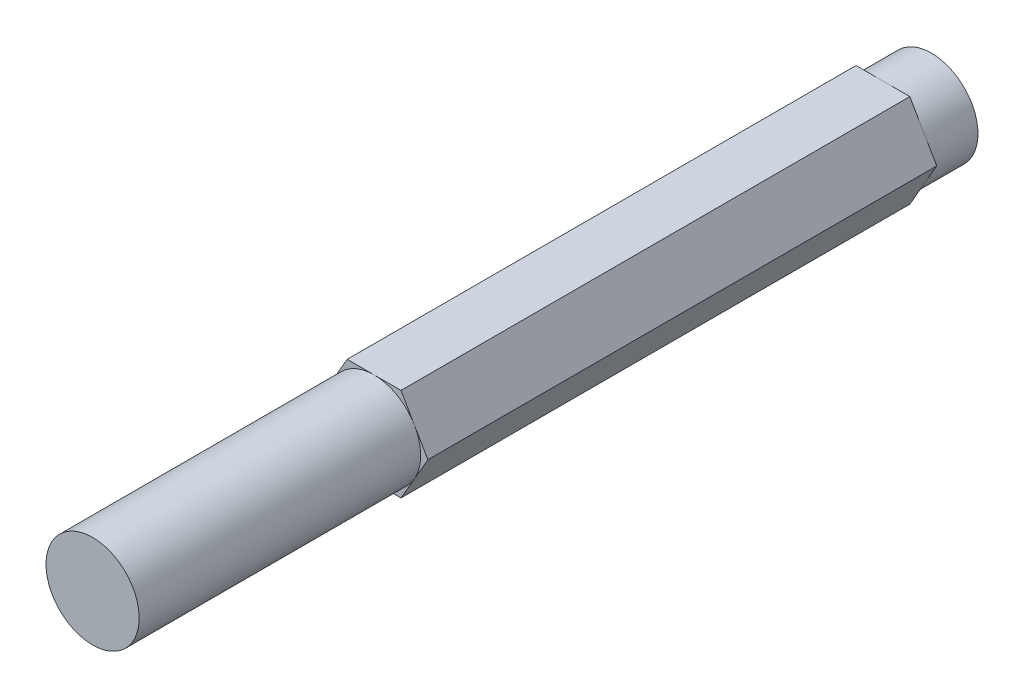
ISO-10303-21;
HEADER;
FILE_DESCRIPTION(('STEP AP214'),'2;1');
FILE_NAME('part.step','',(''),(''),'','','');
FILE_SCHEMA(('AUTOMOTIVE_DESIGN { 1 0 10303 214 1 1 1 1 }'));
ENDSEC;
DATA;
#1=APPLICATION_CONTEXT('core data for automotive mechanical design processes');
#2=APPLICATION_PROTOCOL_DEFINITION('international standard','automotive_design',2000,#1);
#3=PRODUCT_CONTEXT('',#1,'mechanical');
#4=PRODUCT('Part','Part','',(#3));
#5=PRODUCT_RELATED_PRODUCT_CATEGORY('part','',(#4));
#6=PRODUCT_DEFINITION_FORMATION('','',#4);
#7=PRODUCT_DEFINITION_CONTEXT('part definition',#1,'design');
#8=PRODUCT_DEFINITION('design','',#6,#7);
#9=PRODUCT_DEFINITION_SHAPE('','',#8);
#10=(LENGTH_UNIT() NAMED_UNIT(*) SI_UNIT(.MILLI.,.METRE.));
#11=(NAMED_UNIT(*) PLANE_ANGLE_UNIT() SI_UNIT($,.RADIAN.));
#12=(NAMED_UNIT(*) SI_UNIT($,.STERADIAN.) SOLID_ANGLE_UNIT());
#13=UNCERTAINTY_MEASURE_WITH_UNIT(LENGTH_MEASURE(1.E-05),#10,'distance_accuracy_value','');
#14=(GEOMETRIC_REPRESENTATION_CONTEXT(3) GLOBAL_UNCERTAINTY_ASSIGNED_CONTEXT((#13)) GLOBAL_UNIT_ASSIGNED_CONTEXT((#10,
#11,#12)) REPRESENTATION_CONTEXT('',''));
#15=CARTESIAN_POINT('',(0.,0.,0.));
#16=DIRECTION('',(0.,0.,1.));
#17=DIRECTION('',(1.,0.,0.));
#18=AXIS2_PLACEMENT_3D('',#15,#16,#17);
#19=CARTESIAN_POINT('',(0.,0.,114.3));
#20=DIRECTION('',(0.,0.,1.));
#21=DIRECTION('',(1.,0.,0.));
#22=AXIS2_PLACEMENT_3D('',#19,#20,#21);
#23=PLANE('',#22);
#24=CARTESIAN_POINT('',(0.,0.,114.3));
#25=DIRECTION('',(0.,0.,-1.));
#26=DIRECTION('',(-1.,0.,0.));
#27=AXIS2_PLACEMENT_3D('',#24,#25,#26);
#28=CIRCLE('',#27,6.35);
#29=CARTESIAN_POINT('',(-6.35,0.,114.3));
#30=VERTEX_POINT('',#29);
#31=EDGE_CURVE('E355',#30,#30,#28,.T.);
#32=ORIENTED_EDGE('',*,*,#31,.F.);
#33=EDGE_LOOP('',(#32));
#34=FACE_BOUND('',#33,.T.);
#35=ADVANCED_FACE('F144',(#34),#23,.T.);
#36=CARTESIAN_POINT('',(0.,6.35,114.3));
#37=DIRECTION('',(0.,-1.,0.));
#38=DIRECTION('',(0.,0.,-1.));
#39=AXIS2_PLACEMENT_3D('',#36,#37,#38);
#40=PLANE('',#39);
#41=DIRECTION('',(1.,0.,0.));
#42=VECTOR('',#41,1.);
#43=CARTESIAN_POINT('',(0.,6.35000000000002,75.946));
#44=LINE('',#43,#42);
#45=CARTESIAN_POINT('',(-3.66617420935412,6.35,75.946));
#46=VERTEX_POINT('',#45);
#47=CARTESIAN_POINT('',(0.,6.35000000000002,75.946));
#48=VERTEX_POINT('',#47);
#49=EDGE_CURVE('E169',#46,#48,#44,.T.);
#50=ORIENTED_EDGE('',*,*,#49,.T.);
#51=DIRECTION('',(1.,0.,0.));
#52=VECTOR('',#51,1.);
#53=CARTESIAN_POINT('',(0.,6.35000000000002,75.946));
#54=LINE('',#53,#52);
#55=CARTESIAN_POINT('',(3.66617420935412,6.35,75.946));
#56=VERTEX_POINT('',#55);
#57=EDGE_CURVE('E389',#48,#56,#54,.T.);
#58=ORIENTED_EDGE('',*,*,#57,.T.);
#59=DIRECTION('',(0.,0.,-1.));
#60=VECTOR('',#59,1.);
#61=CARTESIAN_POINT('',(3.66617420935412,6.35,114.3));
#62=LINE('',#61,#60);
#63=CARTESIAN_POINT('',(3.66617420935412,6.35,6.604));
#64=VERTEX_POINT('',#63);
#65=EDGE_CURVE('E12',#56,#64,#62,.T.);
#66=ORIENTED_EDGE('',*,*,#65,.T.);
#67=DIRECTION('',(-1.,0.,0.));
#68=VECTOR('',#67,1.);
#69=CARTESIAN_POINT('',(0.,6.35,6.604));
#70=LINE('',#69,#68);
#71=CARTESIAN_POINT('',(0.,6.35,6.604));
#72=VERTEX_POINT('',#71);
#73=EDGE_CURVE('E274',#64,#72,#70,.T.);
#74=ORIENTED_EDGE('',*,*,#73,.T.);
#75=DIRECTION('',(-1.,0.,0.));
#76=VECTOR('',#75,1.);
#77=CARTESIAN_POINT('',(0.,6.35,6.604));
#78=LINE('',#77,#76);
#79=CARTESIAN_POINT('',(-3.66617420935412,6.35,6.604));
#80=VERTEX_POINT('',#79);
#81=EDGE_CURVE('E313',#72,#80,#78,.T.);
#82=ORIENTED_EDGE('',*,*,#81,.T.);
#83=DIRECTION('',(0.,0.,-1.));
#84=VECTOR('',#83,1.);
#85=CARTESIAN_POINT('',(-3.66617420935412,6.35,114.3));
#86=LINE('',#85,#84);
#87=EDGE_CURVE('E148',#46,#80,#86,.T.);
#88=ORIENTED_EDGE('',*,*,#87,.F.);
#89=EDGE_LOOP('',(#50,#58,#66,#74,#82,#88));
#90=FACE_BOUND('',#89,.T.);
#91=ADVANCED_FACE('F446',(#90),#40,.F.);
#92=CARTESIAN_POINT('',(3.66617420935412,-6.35,114.3));
#93=DIRECTION('',(-0.866025403784439,0.5,0.));
#94=DIRECTION('',(-0.5,-0.866025403784439,0.));
#95=AXIS2_PLACEMENT_3D('',#92,#93,#94);
#96=PLANE('',#95);
#97=DIRECTION('',(-0.500000000000003,-0.866025403784437,0.));
#98=VECTOR('',#97,1.);
#99=CARTESIAN_POINT('',(5.49926131403117,-3.17500000000001,75.946));
#100=LINE('',#99,#98);
#101=CARTESIAN_POINT('',(7.33234841870825,0.,75.946));
#102=VERTEX_POINT('',#101);
#103=CARTESIAN_POINT('',(5.49926131403117,-3.17500000000001,75.946));
#104=VERTEX_POINT('',#103);
#105=EDGE_CURVE('E342',#102,#104,#100,.T.);
#106=ORIENTED_EDGE('',*,*,#105,.T.);
#107=DIRECTION('',(-0.500000000000003,-0.866025403784437,0.));
#108=VECTOR('',#107,1.);
#109=CARTESIAN_POINT('',(5.49926131403117,-3.17500000000001,75.946));
#110=LINE('',#109,#108);
#111=CARTESIAN_POINT('',(3.6661742093541,-6.35000000000001,75.946));
#112=VERTEX_POINT('',#111);
#113=EDGE_CURVE('E378',#104,#112,#110,.T.);
#114=ORIENTED_EDGE('',*,*,#113,.T.);
#115=DIRECTION('',(0.,0.,-1.));
#116=VECTOR('',#115,1.);
#117=CARTESIAN_POINT('',(3.66617420935412,-6.35,114.3));
#118=LINE('',#117,#116);
#119=CARTESIAN_POINT('',(3.66617420935412,-6.35,6.604));
#120=VERTEX_POINT('',#119);
#121=EDGE_CURVE('E265',#112,#120,#118,.T.);
#122=ORIENTED_EDGE('',*,*,#121,.T.);
#123=DIRECTION('',(0.5,0.866025403784439,0.));
#124=VECTOR('',#123,1.);
#125=CARTESIAN_POINT('',(5.49926131403118,-3.175,6.604));
#126=LINE('',#125,#124);
#127=CARTESIAN_POINT('',(5.49926131403119,-3.175,6.604));
#128=VERTEX_POINT('',#127);
#129=EDGE_CURVE('E287',#120,#128,#126,.T.);
#130=ORIENTED_EDGE('',*,*,#129,.T.);
#131=DIRECTION('',(0.5,0.866025403784439,0.));
#132=VECTOR('',#131,1.);
#133=CARTESIAN_POINT('',(5.49926131403118,-3.175,6.604));
#134=LINE('',#133,#132);
#135=CARTESIAN_POINT('',(7.33234841870825,0.,6.604));
#136=VERTEX_POINT('',#135);
#137=EDGE_CURVE('E324',#128,#136,#134,.T.);
#138=ORIENTED_EDGE('',*,*,#137,.T.);
#139=DIRECTION('',(0.,0.,-1.));
#140=VECTOR('',#139,1.);
#141=CARTESIAN_POINT('',(7.33234841870825,0.,114.3));
#142=LINE('',#141,#140);
#143=EDGE_CURVE('E270',#102,#136,#142,.T.);
#144=ORIENTED_EDGE('',*,*,#143,.F.);
#145=EDGE_LOOP('',(#106,#114,#122,#130,#138,#144));
#146=FACE_BOUND('',#145,.T.);
#147=ADVANCED_FACE('F413',(#146),#96,.F.);
#148=CARTESIAN_POINT('',(-7.33234841870825,0.,114.3));
#149=DIRECTION('',(0.866025403784439,0.5,0.));
#150=DIRECTION('',(-0.5,0.866025403784439,0.));
#151=AXIS2_PLACEMENT_3D('',#148,#149,#150);
#152=PLANE('',#151);
#153=DIRECTION('',(-0.499999999999993,0.866025403784443,0.));
#154=VECTOR('',#153,1.);
#155=CARTESIAN_POINT('',(-5.4992613140312,-3.17499999999995,75.946));
#156=LINE('',#155,#154);
#157=CARTESIAN_POINT('',(-3.66617420935412,-6.35,75.946));
#158=VERTEX_POINT('',#157);
#159=CARTESIAN_POINT('',(-5.4992613140312,-3.17499999999995,75.946));
#160=VERTEX_POINT('',#159);
#161=EDGE_CURVE('E161',#158,#160,#156,.T.);
#162=ORIENTED_EDGE('',*,*,#161,.T.);
#163=DIRECTION('',(-0.499999999999993,0.866025403784443,0.));
#164=VECTOR('',#163,1.);
#165=CARTESIAN_POINT('',(-5.4992613140312,-3.17499999999995,75.946));
#166=LINE('',#165,#164);
#167=CARTESIAN_POINT('',(-7.33234841870824,0.,75.946));
#168=VERTEX_POINT('',#167);
#169=EDGE_CURVE('E240',#160,#168,#166,.T.);
#170=ORIENTED_EDGE('',*,*,#169,.T.);
#171=DIRECTION('',(0.,0.,-1.));
#172=VECTOR('',#171,1.);
#173=CARTESIAN_POINT('',(-7.33234841870825,0.,114.3));
#174=LINE('',#173,#172);
#175=CARTESIAN_POINT('',(-7.33234841870825,0.,6.604));
#176=VERTEX_POINT('',#175);
#177=EDGE_CURVE('E252',#168,#176,#174,.T.);
#178=ORIENTED_EDGE('',*,*,#177,.T.);
#179=DIRECTION('',(0.5,-0.866025403784439,0.));
#180=VECTOR('',#179,1.);
#181=CARTESIAN_POINT('',(-5.49926131403119,-3.175,6.604));
#182=LINE('',#181,#180);
#183=CARTESIAN_POINT('',(-5.49926131403119,-3.175,6.604));
#184=VERTEX_POINT('',#183);
#185=EDGE_CURVE('E272',#176,#184,#182,.T.);
#186=ORIENTED_EDGE('',*,*,#185,.T.);
#187=DIRECTION('',(0.5,-0.866025403784439,0.));
#188=VECTOR('',#187,1.);
#189=CARTESIAN_POINT('',(-5.49926131403119,-3.175,6.604));
#190=LINE('',#189,#188);
#191=CARTESIAN_POINT('',(-3.66617420935412,-6.35,6.604));
#192=VERTEX_POINT('',#191);
#193=EDGE_CURVE('E335',#184,#192,#190,.T.);
#194=ORIENTED_EDGE('',*,*,#193,.T.);
#195=DIRECTION('',(0.,0.,-1.));
#196=VECTOR('',#195,1.);
#197=CARTESIAN_POINT('',(-3.66617420935412,-6.35,114.3));
#198=LINE('',#197,#196);
#199=EDGE_CURVE('E262',#158,#192,#198,.T.);
#200=ORIENTED_EDGE('',*,*,#199,.F.);
#201=EDGE_LOOP('',(#162,#170,#178,#186,#194,#200));
#202=FACE_BOUND('',#201,.T.);
#203=ADVANCED_FACE('F250',(#202),#152,.F.);
#204=CARTESIAN_POINT('',(0.,0.,0.));
#205=DIRECTION('',(0.,0.,1.));
#206=DIRECTION('',(1.,0.,0.));
#207=AXIS2_PLACEMENT_3D('',#204,#205,#206);
#208=PLANE('',#207);
#209=CARTESIAN_POINT('',(0.,0.,0.));
#210=DIRECTION('',(0.,0.,1.));
#211=DIRECTION('',(1.,0.,0.));
#212=AXIS2_PLACEMENT_3D('',#209,#210,#211);
#213=CIRCLE('',#212,6.35);
#214=CARTESIAN_POINT('',(6.35,0.,0.));
#215=VERTEX_POINT('',#214);
#216=EDGE_CURVE('E295',#215,#215,#213,.T.);
#217=ORIENTED_EDGE('',*,*,#216,.F.);
#218=EDGE_LOOP('',(#217));
#219=FACE_BOUND('',#218,.T.);
#220=ADVANCED_FACE('F470',(#219),#208,.F.);
#221=CARTESIAN_POINT('',(5.49926131403118,3.175,114.3));
#222=DIRECTION('',(-0.866025403784439,-0.5,0.));
#223=DIRECTION('',(0.5,-0.866025403784439,0.));
#224=AXIS2_PLACEMENT_3D('',#221,#222,#223);
#225=PLANE('',#224);
#226=ORIENTED_EDGE('',*,*,#65,.F.);
#227=DIRECTION('',(0.499999999999999,-0.866025403784439,0.));
#228=VECTOR('',#227,1.);
#229=CARTESIAN_POINT('',(5.49926131403118,3.17499999999999,75.946));
#230=LINE('',#229,#228);
#231=CARTESIAN_POINT('',(5.49926131403118,3.17499999999999,75.946));
#232=VERTEX_POINT('',#231);
#233=EDGE_CURVE('E385',#56,#232,#230,.T.);
#234=ORIENTED_EDGE('',*,*,#233,.T.);
#235=DIRECTION('',(0.499999999999999,-0.866025403784439,0.));
#236=VECTOR('',#235,1.);
#237=CARTESIAN_POINT('',(5.49926131403118,3.17499999999999,75.946));
#238=LINE('',#237,#236);
#239=EDGE_CURVE('E347',#232,#102,#238,.T.);
#240=ORIENTED_EDGE('',*,*,#239,.T.);
#241=ORIENTED_EDGE('',*,*,#143,.T.);
#242=DIRECTION('',(-0.5,0.866025403784439,0.));
#243=VECTOR('',#242,1.);
#244=CARTESIAN_POINT('',(5.49926131403118,3.175,6.604));
#245=LINE('',#244,#243);
#246=CARTESIAN_POINT('',(5.49926131403119,3.175,6.604));
#247=VERTEX_POINT('',#246);
#248=EDGE_CURVE('E320',#136,#247,#245,.T.);
#249=ORIENTED_EDGE('',*,*,#248,.T.);
#250=DIRECTION('',(-0.5,0.866025403784439,0.));
#251=VECTOR('',#250,1.);
#252=CARTESIAN_POINT('',(5.49926131403118,3.175,6.604));
#253=LINE('',#252,#251);
#254=EDGE_CURVE('E279',#247,#64,#253,.T.);
#255=ORIENTED_EDGE('',*,*,#254,.T.);
#256=EDGE_LOOP('',(#226,#234,#240,#241,#249,#255));
#257=FACE_BOUND('',#256,.T.);
#258=ADVANCED_FACE('F403',(#257),#225,.F.);
#259=CARTESIAN_POINT('',(-3.66617420935412,-6.35,114.3));
#260=DIRECTION('',(0.,1.,0.));
#261=DIRECTION('',(-1.,0.,0.));
#262=AXIS2_PLACEMENT_3D('',#259,#260,#261);
#263=PLANE('',#262);
#264=ORIENTED_EDGE('',*,*,#121,.F.);
#265=DIRECTION('',(-1.,0.,0.));
#266=VECTOR('',#265,1.);
#267=CARTESIAN_POINT('',(0.,-6.34999999999999,75.946));
#268=LINE('',#267,#266);
#269=CARTESIAN_POINT('',(0.,-6.34999999999999,75.946));
#270=VERTEX_POINT('',#269);
#271=EDGE_CURVE('E371',#112,#270,#268,.T.);
#272=ORIENTED_EDGE('',*,*,#271,.T.);
#273=DIRECTION('',(-1.,0.,0.));
#274=VECTOR('',#273,1.);
#275=CARTESIAN_POINT('',(0.,-6.34999999999999,75.946));
#276=LINE('',#275,#274);
#277=EDGE_CURVE('E358',#270,#158,#276,.T.);
#278=ORIENTED_EDGE('',*,*,#277,.T.);
#279=ORIENTED_EDGE('',*,*,#199,.T.);
#280=DIRECTION('',(1.,0.,0.));
#281=VECTOR('',#280,1.);
#282=CARTESIAN_POINT('',(0.,-6.35,6.604));
#283=LINE('',#282,#281);
#284=CARTESIAN_POINT('',(0.,-6.35,6.604));
#285=VERTEX_POINT('',#284);
#286=EDGE_CURVE('E331',#192,#285,#283,.T.);
#287=ORIENTED_EDGE('',*,*,#286,.T.);
#288=DIRECTION('',(1.,0.,0.));
#289=VECTOR('',#288,1.);
#290=CARTESIAN_POINT('',(0.,-6.35,6.604));
#291=LINE('',#290,#289);
#292=EDGE_CURVE('E304',#285,#120,#291,.T.);
#293=ORIENTED_EDGE('',*,*,#292,.T.);
#294=EDGE_LOOP('',(#264,#272,#278,#279,#287,#293));
#295=FACE_BOUND('',#294,.T.);
#296=ADVANCED_FACE('F430',(#295),#263,.F.);
#297=CARTESIAN_POINT('',(-3.66617420935412,6.35,114.3));
#298=DIRECTION('',(0.866025403784439,-0.5,0.));
#299=DIRECTION('',(0.5,0.866025403784439,0.));
#300=AXIS2_PLACEMENT_3D('',#297,#298,#299);
#301=PLANE('',#300);
#302=ORIENTED_EDGE('',*,*,#177,.F.);
#303=DIRECTION('',(0.500000000000009,0.866025403784434,0.));
#304=VECTOR('',#303,1.);
#305=CARTESIAN_POINT('',(-5.49926131403115,3.17500000000005,75.946));
#306=LINE('',#305,#304);
#307=CARTESIAN_POINT('',(-5.49926131403115,3.17500000000005,75.946));
#308=VERTEX_POINT('',#307);
#309=EDGE_CURVE('E237',#168,#308,#306,.T.);
#310=ORIENTED_EDGE('',*,*,#309,.T.);
#311=DIRECTION('',(0.500000000000009,0.866025403784434,0.));
#312=VECTOR('',#311,1.);
#313=CARTESIAN_POINT('',(-5.49926131403115,3.17500000000005,75.946));
#314=LINE('',#313,#312);
#315=EDGE_CURVE('E365',#308,#46,#314,.T.);
#316=ORIENTED_EDGE('',*,*,#315,.T.);
#317=ORIENTED_EDGE('',*,*,#87,.T.);
#318=DIRECTION('',(-0.5,-0.866025403784439,0.));
#319=VECTOR('',#318,1.);
#320=CARTESIAN_POINT('',(-5.49926131403118,3.175,6.604));
#321=LINE('',#320,#319);
#322=CARTESIAN_POINT('',(-5.49926131403118,3.175,6.604));
#323=VERTEX_POINT('',#322);
#324=EDGE_CURVE('E300',#80,#323,#321,.T.);
#325=ORIENTED_EDGE('',*,*,#324,.T.);
#326=DIRECTION('',(-0.5,-0.866025403784439,0.));
#327=VECTOR('',#326,1.);
#328=CARTESIAN_POINT('',(-5.49926131403118,3.175,6.604));
#329=LINE('',#328,#327);
#330=EDGE_CURVE('E260',#323,#176,#329,.T.);
#331=ORIENTED_EDGE('',*,*,#330,.T.);
#332=EDGE_LOOP('',(#302,#310,#316,#317,#325,#331));
#333=FACE_BOUND('',#332,.T.);
#334=ADVANCED_FACE('F146',(#333),#301,.F.);
#335=CARTESIAN_POINT('',(0.,0.,6.604));
#336=DIRECTION('',(0.,0.,1.));
#337=DIRECTION('',(1.,0.,0.));
#338=AXIS2_PLACEMENT_3D('',#335,#336,#337);
#339=PLANE('',#338);
#340=CARTESIAN_POINT('',(0.,0.,6.604));
#341=DIRECTION('',(0.,0.,1.));
#342=DIRECTION('',(1.,0.,0.));
#343=AXIS2_PLACEMENT_3D('',#340,#341,#342);
#344=CIRCLE('',#343,6.35);
#345=EDGE_CURVE('E278',#323,#184,#344,.T.);
#346=ORIENTED_EDGE('',*,*,#345,.T.);
#347=ORIENTED_EDGE('',*,*,#185,.F.);
#348=ORIENTED_EDGE('',*,*,#330,.F.);
#349=EDGE_LOOP('',(#346,#347,#348));
#350=FACE_BOUND('',#349,.T.);
#351=ADVANCED_FACE('F435',(#350),#339,.F.);
#352=CARTESIAN_POINT('',(0.,0.,6.604));
#353=DIRECTION('',(0.,0.,-1.));
#354=DIRECTION('',(-1.,0.,0.));
#355=AXIS2_PLACEMENT_3D('',#352,#353,#354);
#356=CYLINDRICAL_SURFACE('',#355,6.35);
#357=ORIENTED_EDGE('',*,*,#216,.T.);
#358=EDGE_LOOP('',(#357));
#359=FACE_BOUND('',#358,.T.);
#360=CARTESIAN_POINT('',(0.,0.,6.604));
#361=DIRECTION('',(0.,0.,1.));
#362=DIRECTION('',(1.,0.,0.));
#363=AXIS2_PLACEMENT_3D('',#360,#361,#362);
#364=CIRCLE('',#363,6.35);
#365=EDGE_CURVE('E339',#184,#285,#364,.T.);
#366=ORIENTED_EDGE('',*,*,#365,.F.);
#367=ORIENTED_EDGE('',*,*,#345,.F.);
#368=CARTESIAN_POINT('',(0.,0.,6.604));
#369=DIRECTION('',(0.,0.,1.));
#370=DIRECTION('',(1.,0.,0.));
#371=AXIS2_PLACEMENT_3D('',#368,#369,#370);
#372=CIRCLE('',#371,6.35);
#373=EDGE_CURVE('E317',#72,#323,#372,.T.);
#374=ORIENTED_EDGE('',*,*,#373,.F.);
#375=CARTESIAN_POINT('',(0.,0.,6.604));
#376=DIRECTION('',(0.,0.,1.));
#377=DIRECTION('',(1.,0.,0.));
#378=AXIS2_PLACEMENT_3D('',#375,#376,#377);
#379=CIRCLE('',#378,6.35);
#380=EDGE_CURVE('E283',#247,#72,#379,.T.);
#381=ORIENTED_EDGE('',*,*,#380,.F.);
#382=CARTESIAN_POINT('',(0.,0.,6.604));
#383=DIRECTION('',(0.,0.,1.));
#384=DIRECTION('',(1.,0.,0.));
#385=AXIS2_PLACEMENT_3D('',#382,#383,#384);
#386=CIRCLE('',#385,6.35);
#387=EDGE_CURVE('E328',#128,#247,#386,.T.);
#388=ORIENTED_EDGE('',*,*,#387,.F.);
#389=CARTESIAN_POINT('',(0.,0.,6.604));
#390=DIRECTION('',(0.,0.,1.));
#391=DIRECTION('',(1.,0.,0.));
#392=AXIS2_PLACEMENT_3D('',#389,#390,#391);
#393=CIRCLE('',#392,6.35);
#394=EDGE_CURVE('E299',#285,#128,#393,.T.);
#395=ORIENTED_EDGE('',*,*,#394,.F.);
#396=EDGE_LOOP('',(#366,#367,#374,#381,#388,#395));
#397=FACE_BOUND('',#396,.T.);
#398=ADVANCED_FACE('F424',(#359,#397),#356,.T.);
#399=CARTESIAN_POINT('',(0.,0.,6.604));
#400=DIRECTION('',(0.,0.,1.));
#401=DIRECTION('',(1.,0.,0.));
#402=AXIS2_PLACEMENT_3D('',#399,#400,#401);
#403=PLANE('',#402);
#404=ORIENTED_EDGE('',*,*,#394,.T.);
#405=ORIENTED_EDGE('',*,*,#129,.F.);
#406=ORIENTED_EDGE('',*,*,#292,.F.);
#407=EDGE_LOOP('',(#404,#405,#406));
#408=FACE_BOUND('',#407,.T.);
#409=ADVANCED_FACE('F428',(#408),#403,.F.);
#410=CARTESIAN_POINT('',(0.,0.,6.604));
#411=DIRECTION('',(0.,0.,1.));
#412=DIRECTION('',(1.,0.,0.));
#413=AXIS2_PLACEMENT_3D('',#410,#411,#412);
#414=PLANE('',#413);
#415=ORIENTED_EDGE('',*,*,#380,.T.);
#416=ORIENTED_EDGE('',*,*,#73,.F.);
#417=ORIENTED_EDGE('',*,*,#254,.F.);
#418=EDGE_LOOP('',(#415,#416,#417));
#419=FACE_BOUND('',#418,.T.);
#420=ADVANCED_FACE('F445',(#419),#414,.F.);
#421=CARTESIAN_POINT('',(0.,0.,6.604));
#422=DIRECTION('',(0.,0.,1.));
#423=DIRECTION('',(1.,0.,0.));
#424=AXIS2_PLACEMENT_3D('',#421,#422,#423);
#425=PLANE('',#424);
#426=ORIENTED_EDGE('',*,*,#373,.T.);
#427=ORIENTED_EDGE('',*,*,#324,.F.);
#428=ORIENTED_EDGE('',*,*,#81,.F.);
#429=EDGE_LOOP('',(#426,#427,#428));
#430=FACE_BOUND('',#429,.T.);
#431=ADVANCED_FACE('F440',(#430),#425,.F.);
#432=CARTESIAN_POINT('',(0.,0.,6.604));
#433=DIRECTION('',(0.,0.,1.));
#434=DIRECTION('',(1.,0.,0.));
#435=AXIS2_PLACEMENT_3D('',#432,#433,#434);
#436=PLANE('',#435);
#437=ORIENTED_EDGE('',*,*,#387,.T.);
#438=ORIENTED_EDGE('',*,*,#248,.F.);
#439=ORIENTED_EDGE('',*,*,#137,.F.);
#440=EDGE_LOOP('',(#437,#438,#439));
#441=FACE_BOUND('',#440,.T.);
#442=ADVANCED_FACE('F418',(#441),#436,.F.);
#443=CARTESIAN_POINT('',(0.,0.,6.604));
#444=DIRECTION('',(0.,0.,1.));
#445=DIRECTION('',(1.,0.,0.));
#446=AXIS2_PLACEMENT_3D('',#443,#444,#445);
#447=PLANE('',#446);
#448=ORIENTED_EDGE('',*,*,#365,.T.);
#449=ORIENTED_EDGE('',*,*,#286,.F.);
#450=ORIENTED_EDGE('',*,*,#193,.F.);
#451=EDGE_LOOP('',(#448,#449,#450));
#452=FACE_BOUND('',#451,.T.);
#453=ADVANCED_FACE('F433',(#452),#447,.F.);
#454=CARTESIAN_POINT('',(0.,0.,114.3));
#455=DIRECTION('',(0.,0.,-1.));
#456=DIRECTION('',(-1.,0.,0.));
#457=AXIS2_PLACEMENT_3D('',#454,#455,#456);
#458=CYLINDRICAL_SURFACE('',#457,6.35);
#459=CARTESIAN_POINT('',(0.,0.,75.946));
#460=DIRECTION('',(0.,0.,-1.));
#461=DIRECTION('',(-1.,0.,0.));
#462=AXIS2_PLACEMENT_3D('',#459,#460,#461);
#463=CIRCLE('',#462,6.35);
#464=EDGE_CURVE('E368',#308,#48,#463,.T.);
#465=ORIENTED_EDGE('',*,*,#464,.F.);
#466=CARTESIAN_POINT('',(0.,0.,75.946));
#467=DIRECTION('',(0.,0.,-1.));
#468=DIRECTION('',(-1.,0.,0.));
#469=AXIS2_PLACEMENT_3D('',#466,#467,#468);
#470=CIRCLE('',#469,6.35);
#471=EDGE_CURVE('E242',#160,#308,#470,.T.);
#472=ORIENTED_EDGE('',*,*,#471,.F.);
#473=CARTESIAN_POINT('',(0.,0.,75.946));
#474=DIRECTION('',(0.,0.,-1.));
#475=DIRECTION('',(-1.,0.,0.));
#476=AXIS2_PLACEMENT_3D('',#473,#474,#475);
#477=CIRCLE('',#476,6.35);
#478=EDGE_CURVE('E346',#270,#160,#477,.T.);
#479=ORIENTED_EDGE('',*,*,#478,.F.);
#480=CARTESIAN_POINT('',(0.,0.,75.946));
#481=DIRECTION('',(0.,0.,-1.));
#482=DIRECTION('',(-1.,0.,0.));
#483=AXIS2_PLACEMENT_3D('',#480,#481,#482);
#484=CIRCLE('',#483,6.35);
#485=EDGE_CURVE('E382',#104,#270,#484,.T.);
#486=ORIENTED_EDGE('',*,*,#485,.F.);
#487=CARTESIAN_POINT('',(0.,0.,75.946));
#488=DIRECTION('',(0.,0.,-1.));
#489=DIRECTION('',(-1.,0.,0.));
#490=AXIS2_PLACEMENT_3D('',#487,#488,#489);
#491=CIRCLE('',#490,6.35);
#492=EDGE_CURVE('E351',#232,#104,#491,.T.);
#493=ORIENTED_EDGE('',*,*,#492,.F.);
#494=CARTESIAN_POINT('',(0.,0.,75.946));
#495=DIRECTION('',(0.,0.,-1.));
#496=DIRECTION('',(-1.,0.,0.));
#497=AXIS2_PLACEMENT_3D('',#494,#495,#496);
#498=CIRCLE('',#497,6.35);
#499=EDGE_CURVE('E247',#48,#232,#498,.T.);
#500=ORIENTED_EDGE('',*,*,#499,.F.);
#501=EDGE_LOOP('',(#465,#472,#479,#486,#493,#500));
#502=FACE_BOUND('',#501,.T.);
#503=ORIENTED_EDGE('',*,*,#31,.T.);
#504=EDGE_LOOP('',(#503));
#505=FACE_BOUND('',#504,.T.);
#506=ADVANCED_FACE('F407',(#502,#505),#458,.T.);
#507=CARTESIAN_POINT('',(0.,0.,75.946));
#508=DIRECTION('',(0.,0.,-1.));
#509=DIRECTION('',(-1.,0.,0.));
#510=AXIS2_PLACEMENT_3D('',#507,#508,#509);
#511=PLANE('',#510);
#512=ORIENTED_EDGE('',*,*,#464,.T.);
#513=ORIENTED_EDGE('',*,*,#49,.F.);
#514=ORIENTED_EDGE('',*,*,#315,.F.);
#515=EDGE_LOOP('',(#512,#513,#514));
#516=FACE_BOUND('',#515,.T.);
#517=ADVANCED_FACE('F447',(#516),#511,.F.);
#518=CARTESIAN_POINT('',(0.,0.,75.946));
#519=DIRECTION('',(0.,0.,-1.));
#520=DIRECTION('',(-1.,0.,0.));
#521=AXIS2_PLACEMENT_3D('',#518,#519,#520);
#522=PLANE('',#521);
#523=ORIENTED_EDGE('',*,*,#478,.T.);
#524=ORIENTED_EDGE('',*,*,#161,.F.);
#525=ORIENTED_EDGE('',*,*,#277,.F.);
#526=EDGE_LOOP('',(#523,#524,#525));
#527=FACE_BOUND('',#526,.T.);
#528=ADVANCED_FACE('F448',(#527),#522,.F.);
#529=CARTESIAN_POINT('',(0.,0.,75.946));
#530=DIRECTION('',(0.,0.,-1.));
#531=DIRECTION('',(-1.,0.,0.));
#532=AXIS2_PLACEMENT_3D('',#529,#530,#531);
#533=PLANE('',#532);
#534=ORIENTED_EDGE('',*,*,#492,.T.);
#535=ORIENTED_EDGE('',*,*,#105,.F.);
#536=ORIENTED_EDGE('',*,*,#239,.F.);
#537=EDGE_LOOP('',(#534,#535,#536));
#538=FACE_BOUND('',#537,.T.);
#539=ADVANCED_FACE('F411',(#538),#533,.F.);
#540=CARTESIAN_POINT('',(0.,0.,75.946));
#541=DIRECTION('',(0.,0.,-1.));
#542=DIRECTION('',(-1.,0.,0.));
#543=AXIS2_PLACEMENT_3D('',#540,#541,#542);
#544=PLANE('',#543);
#545=ORIENTED_EDGE('',*,*,#485,.T.);
#546=ORIENTED_EDGE('',*,*,#271,.F.);
#547=ORIENTED_EDGE('',*,*,#113,.F.);
#548=EDGE_LOOP('',(#545,#546,#547));
#549=FACE_BOUND('',#548,.T.);
#550=ADVANCED_FACE('F455',(#549),#544,.F.);
#551=CARTESIAN_POINT('',(0.,0.,75.946));
#552=DIRECTION('',(0.,0.,-1.));
#553=DIRECTION('',(-1.,0.,0.));
#554=AXIS2_PLACEMENT_3D('',#551,#552,#553);
#555=PLANE('',#554);
#556=ORIENTED_EDGE('',*,*,#499,.T.);
#557=ORIENTED_EDGE('',*,*,#233,.F.);
#558=ORIENTED_EDGE('',*,*,#57,.F.);
#559=EDGE_LOOP('',(#556,#557,#558));
#560=FACE_BOUND('',#559,.T.);
#561=ADVANCED_FACE('F398',(#560),#555,.F.);
#562=CARTESIAN_POINT('',(0.,0.,75.946));
#563=DIRECTION('',(0.,0.,-1.));
#564=DIRECTION('',(-1.,0.,0.));
#565=AXIS2_PLACEMENT_3D('',#562,#563,#564);
#566=PLANE('',#565);
#567=ORIENTED_EDGE('',*,*,#471,.T.);
#568=ORIENTED_EDGE('',*,*,#309,.F.);
#569=ORIENTED_EDGE('',*,*,#169,.F.);
#570=EDGE_LOOP('',(#567,#568,#569));
#571=FACE_BOUND('',#570,.T.);
#572=ADVANCED_FACE('F239',(#571),#566,.F.);
#573=CLOSED_SHELL('',(#35,#91,#147,#203,#220,#258,#296,#334,#351,#398,#409,#420,#431,#442,#453,
#506,#517,#528,#539,#550,#561,#572));
#574=MANIFOLD_SOLID_BREP('B2',#573);
#575=ADVANCED_BREP_SHAPE_REPRESENTATION('',(#18,#574),#14);
#576=SHAPE_DEFINITION_REPRESENTATION(#9,#575);
ENDSEC;
END-ISO-10303-21;
